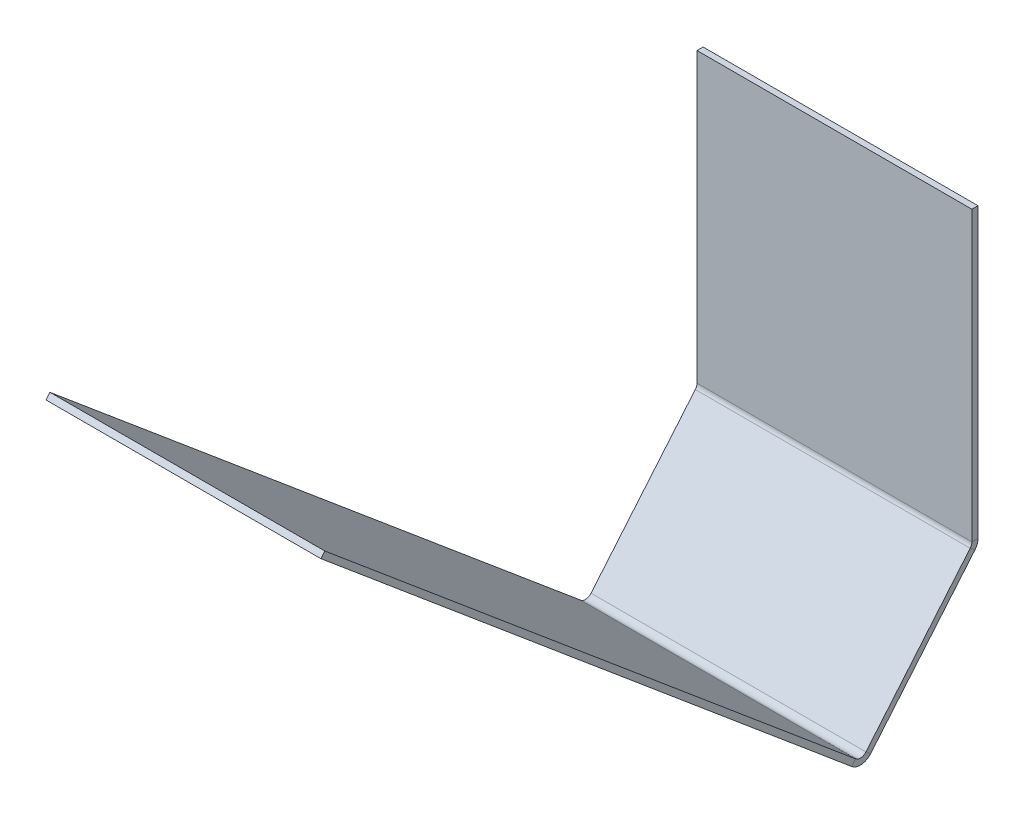
ISO-10303-21;
HEADER;
FILE_DESCRIPTION(('STEP AP214'),'2;1');
FILE_NAME('part.step','',(''),(''),'','','');
FILE_SCHEMA(('AUTOMOTIVE_DESIGN { 1 0 10303 214 1 1 1 1 }'));
ENDSEC;
DATA;
#1=APPLICATION_CONTEXT('core data for automotive mechanical design processes');
#2=APPLICATION_PROTOCOL_DEFINITION('international standard','automotive_design',2000,#1);
#3=PRODUCT_CONTEXT('',#1,'mechanical');
#4=PRODUCT('Part','Part','',(#3));
#5=PRODUCT_RELATED_PRODUCT_CATEGORY('part','',(#4));
#6=PRODUCT_DEFINITION_FORMATION('','',#4);
#7=PRODUCT_DEFINITION_CONTEXT('part definition',#1,'design');
#8=PRODUCT_DEFINITION('design','',#6,#7);
#9=PRODUCT_DEFINITION_SHAPE('','',#8);
#10=(LENGTH_UNIT() NAMED_UNIT(*) SI_UNIT(.MILLI.,.METRE.));
#11=(NAMED_UNIT(*) PLANE_ANGLE_UNIT() SI_UNIT($,.RADIAN.));
#12=(NAMED_UNIT(*) SI_UNIT($,.STERADIAN.) SOLID_ANGLE_UNIT());
#13=UNCERTAINTY_MEASURE_WITH_UNIT(LENGTH_MEASURE(1.E-05),#10,'distance_accuracy_value','');
#14=(GEOMETRIC_REPRESENTATION_CONTEXT(3) GLOBAL_UNCERTAINTY_ASSIGNED_CONTEXT((#13)) GLOBAL_UNIT_ASSIGNED_CONTEXT((#10,
#11,#12)) REPRESENTATION_CONTEXT('',''));
#15=CARTESIAN_POINT('',(0.,0.,0.));
#16=DIRECTION('',(0.,0.,1.));
#17=DIRECTION('',(1.,0.,0.));
#18=AXIS2_PLACEMENT_3D('',#15,#16,#17);
#19=CARTESIAN_POINT('',(0.,89.8724209481772,244.634432404268));
#20=DIRECTION('',(0.,-0.642787609686541,-0.766044443118977));
#21=DIRECTION('',(-1.,0.,0.));
#22=AXIS2_PLACEMENT_3D('',#19,#20,#21);
#23=PLANE('',#22);
#24=DIRECTION('',(0.,-0.766044443118977,0.642787609686541));
#25=VECTOR('',#24,1.);
#26=CARTESIAN_POINT('',(0.,89.8724209481772,244.634432404268));
#27=LINE('',#26,#25);
#28=CARTESIAN_POINT('',(1.38777878078145E-13,380.531139471248,0.742808893097247));
#29=VERTEX_POINT('',#28);
#30=CARTESIAN_POINT('',(0.,326.431417400322,46.137865729605));
#31=VERTEX_POINT('',#30);
#32=EDGE_CURVE('E66',#29,#31,#27,.T.);
#33=ORIENTED_EDGE('',*,*,#32,.T.);
#34=DIRECTION('',(1.,0.,0.));
#35=VECTOR('',#34,1.);
#36=CARTESIAN_POINT('',(2.65441725350325E-13,326.431417400322,46.1378657296051));
#37=LINE('',#36,#35);
#38=CARTESIAN_POINT('',(119.6975,326.431417400322,46.137865729605));
#39=VERTEX_POINT('',#38);
#40=EDGE_CURVE('E58',#31,#39,#37,.T.);
#41=ORIENTED_EDGE('',*,*,#40,.T.);
#42=DIRECTION('',(0.,0.766044443118977,-0.642787609686541));
#43=VECTOR('',#42,1.);
#44=CARTESIAN_POINT('',(119.6975,89.8724209481772,244.634432404268));
#45=LINE('',#44,#43);
#46=CARTESIAN_POINT('',(119.6975,380.531139471248,0.742808893097247));
#47=VERTEX_POINT('',#46);
#48=EDGE_CURVE('E74',#39,#47,#45,.T.);
#49=ORIENTED_EDGE('',*,*,#48,.T.);
#50=DIRECTION('',(1.,0.,0.));
#51=VECTOR('',#50,1.);
#52=CARTESIAN_POINT('',(0.,380.531139471248,0.742808893097247));
#53=LINE('',#52,#51);
#54=EDGE_CURVE('E234',#29,#47,#53,.T.);
#55=ORIENTED_EDGE('',*,*,#54,.F.);
#56=EDGE_LOOP('',(#33,#41,#49,#55));
#57=FACE_BOUND('',#56,.T.);
#58=ADVANCED_FACE('F49',(#57),#23,.F.);
#59=CARTESIAN_POINT('',(0.,88.1646371152576,242.599174886012));
#60=DIRECTION('',(-1.,0.,0.));
#61=DIRECTION('',(0.,0.642787609686541,0.766044443118977));
#62=AXIS2_PLACEMENT_3D('',#59,#60,#61);
#63=PLANE('',#62);
#64=DIRECTION('',(0.,-0.64278760968654,-0.766044443118977));
#65=VECTOR('',#64,1.);
#66=CARTESIAN_POINT('',(0.,324.723633567403,44.1026082113489));
#67=LINE('',#66,#65);
#68=CARTESIAN_POINT('',(0.,324.723633567403,44.1026082113487));
#69=VERTEX_POINT('',#68);
#70=EDGE_CURVE('E12',#31,#69,#67,.T.);
#71=ORIENTED_EDGE('',*,*,#70,.F.);
#72=ORIENTED_EDGE('',*,*,#32,.F.);
#73=DIRECTION('',(0.,-0.642787609686535,-0.766044443118982));
#74=VECTOR('',#73,1.);
#75=CARTESIAN_POINT('',(0.,378.823355638331,-1.29244862515696));
#76=LINE('',#75,#74);
#77=CARTESIAN_POINT('',(0.,378.823355638329,-1.29244862515898));
#78=VERTEX_POINT('',#77);
#79=EDGE_CURVE('E231',#29,#78,#76,.T.);
#80=ORIENTED_EDGE('',*,*,#79,.T.);
#81=DIRECTION('',(0.,-0.766044443118977,0.642787609686541));
#82=VECTOR('',#81,1.);
#83=CARTESIAN_POINT('',(0.,88.1646371152576,242.599174886012));
#84=LINE('',#83,#82);
#85=EDGE_CURVE('E246',#78,#69,#84,.T.);
#86=ORIENTED_EDGE('',*,*,#85,.T.);
#87=EDGE_LOOP('',(#71,#72,#80,#86));
#88=FACE_BOUND('',#87,.T.);
#89=ADVANCED_FACE('F51',(#88),#63,.T.);
#90=CARTESIAN_POINT('',(119.6975,88.1646371152576,242.599174886012));
#91=DIRECTION('',(1.,0.,0.));
#92=DIRECTION('',(0.,-0.642787609686541,-0.766044443118977));
#93=AXIS2_PLACEMENT_3D('',#90,#91,#92);
#94=PLANE('',#93);
#95=DIRECTION('',(0.,0.64278760968654,0.766044443118977));
#96=VECTOR('',#95,1.);
#97=CARTESIAN_POINT('',(119.6975,324.723633567402,44.102608211349));
#98=LINE('',#97,#96);
#99=CARTESIAN_POINT('',(119.6975,324.723633567403,44.1026082113488));
#100=VERTEX_POINT('',#99);
#101=EDGE_CURVE('E242',#100,#39,#98,.T.);
#102=ORIENTED_EDGE('',*,*,#101,.F.);
#103=DIRECTION('',(0.,0.766044443118977,-0.642787609686541));
#104=VECTOR('',#103,1.);
#105=CARTESIAN_POINT('',(119.6975,88.1646371152576,242.599174886012));
#106=LINE('',#105,#104);
#107=CARTESIAN_POINT('',(119.6975,378.823355638329,-1.29244862515898));
#108=VERTEX_POINT('',#107);
#109=EDGE_CURVE('E53',#100,#108,#106,.T.);
#110=ORIENTED_EDGE('',*,*,#109,.T.);
#111=DIRECTION('',(0.,0.642787609686535,0.766044443118982));
#112=VECTOR('',#111,1.);
#113=CARTESIAN_POINT('',(119.6975,378.823355638331,-1.29244862515696));
#114=LINE('',#113,#112);
#115=EDGE_CURVE('E237',#108,#47,#114,.T.);
#116=ORIENTED_EDGE('',*,*,#115,.T.);
#117=ORIENTED_EDGE('',*,*,#48,.F.);
#118=EDGE_LOOP('',(#102,#110,#116,#117));
#119=FACE_BOUND('',#118,.T.);
#120=ADVANCED_FACE('F259',(#119),#94,.T.);
#121=CARTESIAN_POINT('',(0.,88.1646371152576,242.599174886012));
#122=DIRECTION('',(0.,-0.642787609686541,-0.766044443118977));
#123=DIRECTION('',(-1.,0.,0.));
#124=AXIS2_PLACEMENT_3D('',#121,#122,#123);
#125=PLANE('',#124);
#126=DIRECTION('',(1.,0.,0.));
#127=VECTOR('',#126,1.);
#128=CARTESIAN_POINT('',(2.65441725350325E-13,324.723633567403,44.1026082113488));
#129=LINE('',#128,#127);
#130=EDGE_CURVE('E239',#69,#100,#129,.T.);
#131=ORIENTED_EDGE('',*,*,#130,.F.);
#132=ORIENTED_EDGE('',*,*,#85,.F.);
#133=DIRECTION('',(1.,0.,0.));
#134=VECTOR('',#133,1.);
#135=CARTESIAN_POINT('',(0.,378.823355638329,-1.29244862515898));
#136=LINE('',#135,#134);
#137=EDGE_CURVE('E228',#78,#108,#136,.T.);
#138=ORIENTED_EDGE('',*,*,#137,.T.);
#139=ORIENTED_EDGE('',*,*,#109,.F.);
#140=EDGE_LOOP('',(#131,#132,#138,#139));
#141=FACE_BOUND('',#140,.T.);
#142=ADVANCED_FACE('F301',(#141),#125,.T.);
#143=CARTESIAN_POINT('',(0.,508.,-2.65684));
#144=DIRECTION('',(0.,1.,0.));
#145=DIRECTION('',(0.,0.,1.));
#146=AXIS2_PLACEMENT_3D('',#143,#144,#145);
#147=PLANE('',#146);
#148=DIRECTION('',(-1.,0.,0.));
#149=VECTOR('',#148,1.);
#150=CARTESIAN_POINT('',(0.,508.,0.));
#151=LINE('',#150,#149);
#152=CARTESIAN_POINT('',(119.6975,508.,0.));
#153=VERTEX_POINT('',#152);
#154=CARTESIAN_POINT('',(0.,508.,0.));
#155=VERTEX_POINT('',#154);
#156=EDGE_CURVE('E203',#153,#155,#151,.T.);
#157=ORIENTED_EDGE('',*,*,#156,.F.);
#158=DIRECTION('',(0.,0.,1.));
#159=VECTOR('',#158,1.);
#160=CARTESIAN_POINT('',(119.6975,508.,-2.65684));
#161=LINE('',#160,#159);
#162=CARTESIAN_POINT('',(119.6975,508.,-2.65684));
#163=VERTEX_POINT('',#162);
#164=EDGE_CURVE('E198',#163,#153,#161,.T.);
#165=ORIENTED_EDGE('',*,*,#164,.F.);
#166=DIRECTION('',(-1.,0.,0.));
#167=VECTOR('',#166,1.);
#168=CARTESIAN_POINT('',(0.,508.,-2.65684));
#169=LINE('',#168,#167);
#170=CARTESIAN_POINT('',(0.,508.,-2.65684));
#171=VERTEX_POINT('',#170);
#172=EDGE_CURVE('E217',#163,#171,#169,.T.);
#173=ORIENTED_EDGE('',*,*,#172,.T.);
#174=DIRECTION('',(0.,0.,1.));
#175=VECTOR('',#174,1.);
#176=CARTESIAN_POINT('',(0.,508.,-2.65684));
#177=LINE('',#176,#175);
#178=EDGE_CURVE('E215',#171,#155,#177,.T.);
#179=ORIENTED_EDGE('',*,*,#178,.T.);
#180=EDGE_LOOP('',(#157,#165,#173,#179));
#181=FACE_BOUND('',#180,.T.);
#182=ADVANCED_FACE('F282',(#181),#147,.T.);
#183=CARTESIAN_POINT('',(0.,0.,-2.65684));
#184=DIRECTION('',(0.,0.,-1.));
#185=DIRECTION('',(-1.,0.,0.));
#186=AXIS2_PLACEMENT_3D('',#183,#184,#185);
#187=PLANE('',#186);
#188=DIRECTION('',(1.,0.,0.));
#189=VECTOR('',#188,1.);
#190=CARTESIAN_POINT('',(0.,382.571990132003,-2.65684));
#191=LINE('',#190,#189);
#192=CARTESIAN_POINT('',(0.,382.571990132003,-2.65684));
#193=VERTEX_POINT('',#192);
#194=CARTESIAN_POINT('',(119.6975,382.571990132003,-2.65684));
#195=VERTEX_POINT('',#194);
#196=EDGE_CURVE('E193',#193,#195,#191,.T.);
#197=ORIENTED_EDGE('',*,*,#196,.F.);
#198=DIRECTION('',(0.,-1.,0.));
#199=VECTOR('',#198,1.);
#200=CARTESIAN_POINT('',(0.,0.,-2.65684));
#201=LINE('',#200,#199);
#202=EDGE_CURVE('E213',#171,#193,#201,.T.);
#203=ORIENTED_EDGE('',*,*,#202,.F.);
#204=ORIENTED_EDGE('',*,*,#172,.F.);
#205=DIRECTION('',(0.,1.,0.));
#206=VECTOR('',#205,1.);
#207=CARTESIAN_POINT('',(119.6975,0.,-2.65684));
#208=LINE('',#207,#206);
#209=EDGE_CURVE('E201',#195,#163,#208,.T.);
#210=ORIENTED_EDGE('',*,*,#209,.F.);
#211=EDGE_LOOP('',(#197,#203,#204,#210));
#212=FACE_BOUND('',#211,.T.);
#213=ADVANCED_FACE('F268',(#212),#187,.T.);
#214=CARTESIAN_POINT('',(0.,0.,-2.65684));
#215=DIRECTION('',(-1.,0.,0.));
#216=DIRECTION('',(0.,0.,1.));
#217=AXIS2_PLACEMENT_3D('',#214,#215,#216);
#218=PLANE('',#217);
#219=DIRECTION('',(0.,0.,-1.));
#220=VECTOR('',#219,1.);
#221=CARTESIAN_POINT('',(0.,382.571990132003,-2.65683999999733));
#222=LINE('',#221,#220);
#223=CARTESIAN_POINT('',(0.,382.571990132003,0.));
#224=VERTEX_POINT('',#223);
#225=EDGE_CURVE('E220',#224,#193,#222,.T.);
#226=ORIENTED_EDGE('',*,*,#225,.F.);
#227=DIRECTION('',(0.,-1.,0.));
#228=VECTOR('',#227,1.);
#229=CARTESIAN_POINT('',(0.,0.,0.));
#230=LINE('',#229,#228);
#231=EDGE_CURVE('E211',#155,#224,#230,.T.);
#232=ORIENTED_EDGE('',*,*,#231,.F.);
#233=ORIENTED_EDGE('',*,*,#178,.F.);
#234=ORIENTED_EDGE('',*,*,#202,.T.);
#235=EDGE_LOOP('',(#226,#232,#233,#234));
#236=FACE_BOUND('',#235,.T.);
#237=ADVANCED_FACE('F276',(#236),#218,.T.);
#238=CARTESIAN_POINT('',(0.,0.,0.));
#239=DIRECTION('',(0.,0.,-1.));
#240=DIRECTION('',(-1.,0.,0.));
#241=AXIS2_PLACEMENT_3D('',#238,#239,#240);
#242=PLANE('',#241);
#243=ORIENTED_EDGE('',*,*,#231,.T.);
#244=DIRECTION('',(1.,0.,0.));
#245=VECTOR('',#244,1.);
#246=CARTESIAN_POINT('',(0.,382.571990132003,0.));
#247=LINE('',#246,#245);
#248=CARTESIAN_POINT('',(119.6975,382.571990132003,0.));
#249=VERTEX_POINT('',#248);
#250=EDGE_CURVE('E208',#224,#249,#247,.T.);
#251=ORIENTED_EDGE('',*,*,#250,.T.);
#252=DIRECTION('',(0.,1.,0.));
#253=VECTOR('',#252,1.);
#254=CARTESIAN_POINT('',(119.6975,0.,0.));
#255=LINE('',#254,#253);
#256=EDGE_CURVE('E206',#249,#153,#255,.T.);
#257=ORIENTED_EDGE('',*,*,#256,.T.);
#258=ORIENTED_EDGE('',*,*,#156,.T.);
#259=EDGE_LOOP('',(#243,#251,#257,#258));
#260=FACE_BOUND('',#259,.T.);
#261=ADVANCED_FACE('F278',(#260),#242,.F.);
#262=CARTESIAN_POINT('',(119.6975,0.,-2.65684));
#263=DIRECTION('',(1.,0.,0.));
#264=DIRECTION('',(0.,0.,-1.));
#265=AXIS2_PLACEMENT_3D('',#262,#263,#264);
#266=PLANE('',#265);
#267=DIRECTION('',(0.,0.,1.));
#268=VECTOR('',#267,1.);
#269=CARTESIAN_POINT('',(119.6975,382.571990132003,-2.65683999999733));
#270=LINE('',#269,#268);
#271=EDGE_CURVE('E223',#195,#249,#270,.T.);
#272=ORIENTED_EDGE('',*,*,#271,.F.);
#273=ORIENTED_EDGE('',*,*,#209,.T.);
#274=ORIENTED_EDGE('',*,*,#164,.T.);
#275=ORIENTED_EDGE('',*,*,#256,.F.);
#276=EDGE_LOOP('',(#272,#273,#274,#275));
#277=FACE_BOUND('',#276,.T.);
#278=ADVANCED_FACE('F284',(#277),#266,.T.);
#279=CARTESIAN_POINT('',(0.,382.571990132003,3.175));
#280=DIRECTION('',(-1.,0.,0.));
#281=DIRECTION('',(0.,0.,1.));
#282=AXIS2_PLACEMENT_3D('',#279,#280,#281);
#283=PLANE('',#282);
#284=ORIENTED_EDGE('',*,*,#79,.F.);
#285=CARTESIAN_POINT('',(1.11022302462516E-13,382.571990132003,3.175));
#286=DIRECTION('',(-1.,0.,0.));
#287=DIRECTION('',(0.,0.,1.));
#288=AXIS2_PLACEMENT_3D('',#285,#286,#287);
#289=CIRCLE('',#288,3.175);
#290=EDGE_CURVE('E181',#29,#224,#289,.F.);
#291=ORIENTED_EDGE('',*,*,#290,.T.);
#292=ORIENTED_EDGE('',*,*,#225,.T.);
#293=CARTESIAN_POINT('',(0.,382.571990132003,3.175));
#294=DIRECTION('',(1.,0.,0.));
#295=DIRECTION('',(0.,0.,1.));
#296=AXIS2_PLACEMENT_3D('',#293,#294,#295);
#297=CIRCLE('',#296,5.83184);
#298=EDGE_CURVE('E186',#78,#193,#297,.T.);
#299=ORIENTED_EDGE('',*,*,#298,.F.);
#300=EDGE_LOOP('',(#284,#291,#292,#299));
#301=FACE_BOUND('',#300,.T.);
#302=ADVANCED_FACE('F272',(#301),#283,.T.);
#303=CARTESIAN_POINT('',(119.6975,382.571990132003,3.175));
#304=DIRECTION('',(1.,0.,0.));
#305=DIRECTION('',(0.,0.,-1.));
#306=AXIS2_PLACEMENT_3D('',#303,#304,#305);
#307=PLANE('',#306);
#308=CARTESIAN_POINT('',(119.6975,382.571990132003,3.175));
#309=DIRECTION('',(-1.,0.,0.));
#310=DIRECTION('',(0.,0.,1.));
#311=AXIS2_PLACEMENT_3D('',#308,#309,#310);
#312=CIRCLE('',#311,3.175);
#313=EDGE_CURVE('E190',#249,#47,#312,.T.);
#314=ORIENTED_EDGE('',*,*,#313,.T.);
#315=ORIENTED_EDGE('',*,*,#115,.F.);
#316=CARTESIAN_POINT('',(119.6975,382.571990132003,3.175));
#317=DIRECTION('',(-1.,0.,0.));
#318=DIRECTION('',(0.,0.,-1.));
#319=AXIS2_PLACEMENT_3D('',#316,#317,#318);
#320=CIRCLE('',#319,5.83184);
#321=EDGE_CURVE('E189',#195,#108,#320,.T.);
#322=ORIENTED_EDGE('',*,*,#321,.F.);
#323=ORIENTED_EDGE('',*,*,#271,.T.);
#324=EDGE_LOOP('',(#314,#315,#322,#323));
#325=FACE_BOUND('',#324,.T.);
#326=ADVANCED_FACE('F256',(#325),#307,.T.);
#327=CARTESIAN_POINT('',(179.61700504672,382.571990132003,3.175));
#328=DIRECTION('',(-1.,0.,0.));
#329=DIRECTION('',(0.,0.,1.));
#330=AXIS2_PLACEMENT_3D('',#327,#328,#329);
#331=CYLINDRICAL_SURFACE('',#330,5.83184);
#332=ORIENTED_EDGE('',*,*,#196,.T.);
#333=ORIENTED_EDGE('',*,*,#321,.T.);
#334=ORIENTED_EDGE('',*,*,#137,.F.);
#335=ORIENTED_EDGE('',*,*,#298,.T.);
#336=EDGE_LOOP('',(#332,#333,#334,#335));
#337=FACE_BOUND('',#336,.T.);
#338=ADVANCED_FACE('F263',(#337),#331,.T.);
#339=CARTESIAN_POINT('',(179.61700504672,382.571990132003,3.175));
#340=DIRECTION('',(-1.,0.,0.));
#341=DIRECTION('',(0.,0.,1.));
#342=AXIS2_PLACEMENT_3D('',#339,#340,#341);
#343=CYLINDRICAL_SURFACE('',#342,3.175);
#344=ORIENTED_EDGE('',*,*,#250,.F.);
#345=ORIENTED_EDGE('',*,*,#290,.F.);
#346=ORIENTED_EDGE('',*,*,#54,.T.);
#347=ORIENTED_EDGE('',*,*,#313,.F.);
#348=EDGE_LOOP('',(#344,#345,#346,#347));
#349=FACE_BOUND('',#348,.T.);
#350=ADVANCED_FACE('F253',(#349),#343,.F.);
#351=CARTESIAN_POINT('',(0.,328.472268061077,48.5700568365078));
#352=DIRECTION('',(-1.,0.,0.));
#353=DIRECTION('',(0.,-1.,0.));
#354=AXIS2_PLACEMENT_3D('',#351,#352,#353);
#355=PLANE('',#354);
#356=DIRECTION('',(0.,-0.766044443118975,0.642787609686543));
#357=VECTOR('',#356,1.);
#358=CARTESIAN_POINT('',(0.,324.004819435918,52.3186913301822));
#359=LINE('',#358,#357);
#360=CARTESIAN_POINT('',(0.,326.040076954174,50.6109074972625));
#361=VERTEX_POINT('',#360);
#362=CARTESIAN_POINT('',(0.,324.004819435918,52.3186913301823));
#363=VERTEX_POINT('',#362);
#364=EDGE_CURVE('E148',#361,#363,#359,.T.);
#365=ORIENTED_EDGE('',*,*,#364,.F.);
#366=CARTESIAN_POINT('',(0.,328.472268061077,48.5700568365078));
#367=DIRECTION('',(-1.,0.,0.));
#368=DIRECTION('',(0.,-1.,0.));
#369=AXIS2_PLACEMENT_3D('',#366,#367,#368);
#370=CIRCLE('',#369,3.175);
#371=EDGE_CURVE('E159',#361,#31,#370,.F.);
#372=ORIENTED_EDGE('',*,*,#371,.T.);
#373=ORIENTED_EDGE('',*,*,#70,.T.);
#374=CARTESIAN_POINT('',(0.,328.472268061077,48.5700568365078));
#375=DIRECTION('',(1.,0.,0.));
#376=DIRECTION('',(0.,-1.,0.));
#377=AXIS2_PLACEMENT_3D('',#374,#375,#376);
#378=CIRCLE('',#377,5.83184);
#379=EDGE_CURVE('E174',#363,#69,#378,.T.);
#380=ORIENTED_EDGE('',*,*,#379,.F.);
#381=EDGE_LOOP('',(#365,#372,#373,#380));
#382=FACE_BOUND('',#381,.T.);
#383=ADVANCED_FACE('F311',(#382),#355,.T.);
#384=CARTESIAN_POINT('',(119.6975,328.472268061077,48.5700568365079));
#385=DIRECTION('',(1.,0.,0.));
#386=DIRECTION('',(0.,1.,0.));
#387=AXIS2_PLACEMENT_3D('',#384,#385,#386);
#388=PLANE('',#387);
#389=CARTESIAN_POINT('',(119.6975,328.472268061077,48.5700568365079));
#390=DIRECTION('',(-1.,0.,0.));
#391=DIRECTION('',(0.,-1.,0.));
#392=AXIS2_PLACEMENT_3D('',#389,#390,#391);
#393=CIRCLE('',#392,3.175);
#394=CARTESIAN_POINT('',(119.6975,326.040076954174,50.6109074972625));
#395=VERTEX_POINT('',#394);
#396=EDGE_CURVE('E178',#39,#395,#393,.T.);
#397=ORIENTED_EDGE('',*,*,#396,.T.);
#398=DIRECTION('',(0.,0.766044443118975,-0.642787609686543));
#399=VECTOR('',#398,1.);
#400=CARTESIAN_POINT('',(119.6975,324.004819435918,52.3186913301822));
#401=LINE('',#400,#399);
#402=CARTESIAN_POINT('',(119.6975,324.004819435918,52.3186913301822));
#403=VERTEX_POINT('',#402);
#404=EDGE_CURVE('E314',#403,#395,#401,.T.);
#405=ORIENTED_EDGE('',*,*,#404,.F.);
#406=CARTESIAN_POINT('',(119.6975,328.472268061077,48.5700568365079));
#407=DIRECTION('',(-1.,0.,0.));
#408=DIRECTION('',(0.,1.,0.));
#409=AXIS2_PLACEMENT_3D('',#406,#407,#408);
#410=CIRCLE('',#409,5.83183999999994);
#411=EDGE_CURVE('E177',#100,#403,#410,.T.);
#412=ORIENTED_EDGE('',*,*,#411,.F.);
#413=ORIENTED_EDGE('',*,*,#101,.T.);
#414=EDGE_LOOP('',(#397,#405,#412,#413));
#415=FACE_BOUND('',#414,.T.);
#416=ADVANCED_FACE('F335',(#415),#388,.T.);
#417=CARTESIAN_POINT('',(179.938753046781,328.472268061077,48.5700568365079));
#418=DIRECTION('',(-1.,0.,0.));
#419=DIRECTION('',(0.,-1.,0.));
#420=AXIS2_PLACEMENT_3D('',#417,#418,#419);
#421=CYLINDRICAL_SURFACE('',#420,5.83184);
#422=ORIENTED_EDGE('',*,*,#130,.T.);
#423=ORIENTED_EDGE('',*,*,#411,.T.);
#424=DIRECTION('',(1.,0.,0.));
#425=VECTOR('',#424,1.);
#426=CARTESIAN_POINT('',(2.60428822485665E-13,324.004819435918,52.3186913301822));
#427=LINE('',#426,#425);
#428=EDGE_CURVE('E168',#363,#403,#427,.T.);
#429=ORIENTED_EDGE('',*,*,#428,.F.);
#430=ORIENTED_EDGE('',*,*,#379,.T.);
#431=EDGE_LOOP('',(#422,#423,#429,#430));
#432=FACE_BOUND('',#431,.T.);
#433=ADVANCED_FACE('F313',(#432),#421,.T.);
#434=CARTESIAN_POINT('',(179.938753046781,328.472268061077,48.5700568365079));
#435=DIRECTION('',(-1.,0.,0.));
#436=DIRECTION('',(0.,-1.,0.));
#437=AXIS2_PLACEMENT_3D('',#434,#435,#436);
#438=CYLINDRICAL_SURFACE('',#437,3.175);
#439=ORIENTED_EDGE('',*,*,#40,.F.);
#440=ORIENTED_EDGE('',*,*,#371,.F.);
#441=DIRECTION('',(1.,0.,0.));
#442=VECTOR('',#441,1.);
#443=CARTESIAN_POINT('',(2.62712575271568E-13,326.040076954174,50.6109074972626));
#444=LINE('',#443,#442);
#445=EDGE_CURVE('E166',#361,#395,#444,.T.);
#446=ORIENTED_EDGE('',*,*,#445,.T.);
#447=ORIENTED_EDGE('',*,*,#396,.F.);
#448=EDGE_LOOP('',(#439,#440,#446,#447));
#449=FACE_BOUND('',#448,.T.);
#450=ADVANCED_FACE('F334',(#449),#438,.F.);
#451=CARTESIAN_POINT('',(2.60428822485666E-13,517.954335103276,283.458723408661));
#452=DIRECTION('',(0.,0.642787609686543,0.766044443118975));
#453=DIRECTION('',(0.,-0.766044443118975,0.642787609686543));
#454=AXIS2_PLACEMENT_3D('',#451,#452,#453);
#455=PLANE('',#454);
#456=DIRECTION('',(1.,0.,0.));
#457=VECTOR('',#456,1.);
#458=CARTESIAN_POINT('',(2.62712575271569E-13,519.989592621532,281.750939575741));
#459=LINE('',#458,#457);
#460=CARTESIAN_POINT('',(2.62712575271569E-13,519.989592621532,281.750939575741));
#461=VERTEX_POINT('',#460);
#462=CARTESIAN_POINT('',(119.6975,519.989592621532,281.750939575741));
#463=VERTEX_POINT('',#462);
#464=EDGE_CURVE('E158',#461,#463,#459,.T.);
#465=ORIENTED_EDGE('',*,*,#464,.F.);
#466=DIRECTION('',(0.,0.766044443118975,-0.642787609686543));
#467=VECTOR('',#466,1.);
#468=CARTESIAN_POINT('',(2.60428822485666E-13,517.954335103276,283.458723408661));
#469=LINE('',#468,#467);
#470=CARTESIAN_POINT('',(2.60428822485666E-13,517.954335103276,283.458723408661));
#471=VERTEX_POINT('',#470);
#472=EDGE_CURVE('E145',#471,#461,#469,.T.);
#473=ORIENTED_EDGE('',*,*,#472,.F.);
#474=DIRECTION('',(1.,0.,0.));
#475=VECTOR('',#474,1.);
#476=CARTESIAN_POINT('',(2.60428822485666E-13,517.954335103276,283.458723408661));
#477=LINE('',#476,#475);
#478=CARTESIAN_POINT('',(119.6975,517.954335103276,283.458723408661));
#479=VERTEX_POINT('',#478);
#480=EDGE_CURVE('E156',#471,#479,#477,.T.);
#481=ORIENTED_EDGE('',*,*,#480,.T.);
#482=DIRECTION('',(0.,0.766044443118975,-0.642787609686543));
#483=VECTOR('',#482,1.);
#484=CARTESIAN_POINT('',(119.6975,517.954335103276,283.458723408661));
#485=LINE('',#484,#483);
#486=EDGE_CURVE('E165',#479,#463,#485,.T.);
#487=ORIENTED_EDGE('',*,*,#486,.T.);
#488=EDGE_LOOP('',(#465,#473,#481,#487));
#489=FACE_BOUND('',#488,.T.);
#490=ADVANCED_FACE('F155',(#489),#455,.T.);
#491=CARTESIAN_POINT('',(2.60428822485666E-13,517.954335103276,283.458723408661));
#492=DIRECTION('',(0.,-0.766044443118975,0.642787609686543));
#493=DIRECTION('',(-1.,0.,0.));
#494=AXIS2_PLACEMENT_3D('',#491,#492,#493);
#495=PLANE('',#494);
#496=DIRECTION('',(0.,0.642787609686543,0.766044443118975));
#497=VECTOR('',#496,1.);
#498=CARTESIAN_POINT('',(2.60428822485666E-13,517.954335103276,283.458723408661));
#499=LINE('',#498,#497);
#500=EDGE_CURVE('E142',#363,#471,#499,.T.);
#501=ORIENTED_EDGE('',*,*,#500,.F.);
#502=ORIENTED_EDGE('',*,*,#428,.T.);
#503=DIRECTION('',(0.,-0.642787609686543,-0.766044443118975));
#504=VECTOR('',#503,1.);
#505=CARTESIAN_POINT('',(119.6975,517.954335103276,283.458723408661));
#506=LINE('',#505,#504);
#507=EDGE_CURVE('E164',#479,#403,#506,.T.);
#508=ORIENTED_EDGE('',*,*,#507,.F.);
#509=ORIENTED_EDGE('',*,*,#480,.F.);
#510=EDGE_LOOP('',(#501,#502,#508,#509));
#511=FACE_BOUND('',#510,.T.);
#512=ADVANCED_FACE('F162',(#511),#495,.T.);
#513=CARTESIAN_POINT('',(119.6975,517.954335103276,283.458723408661));
#514=DIRECTION('',(1.,0.,0.));
#515=DIRECTION('',(0.,-0.766044443118975,0.642787609686543));
#516=AXIS2_PLACEMENT_3D('',#513,#514,#515);
#517=PLANE('',#516);
#518=ORIENTED_EDGE('',*,*,#507,.T.);
#519=ORIENTED_EDGE('',*,*,#404,.T.);
#520=DIRECTION('',(0.,-0.642787609686543,-0.766044443118975));
#521=VECTOR('',#520,1.);
#522=CARTESIAN_POINT('',(119.6975,519.989592621532,281.750939575741));
#523=LINE('',#522,#521);
#524=EDGE_CURVE('E322',#463,#395,#523,.T.);
#525=ORIENTED_EDGE('',*,*,#524,.F.);
#526=ORIENTED_EDGE('',*,*,#486,.F.);
#527=EDGE_LOOP('',(#518,#519,#525,#526));
#528=FACE_BOUND('',#527,.T.);
#529=ADVANCED_FACE('F330',(#528),#517,.T.);
#530=CARTESIAN_POINT('',(2.62712575271569E-13,519.989592621532,281.750939575741));
#531=DIRECTION('',(0.,-0.766044443118975,0.642787609686543));
#532=DIRECTION('',(-1.,0.,0.));
#533=AXIS2_PLACEMENT_3D('',#530,#531,#532);
#534=PLANE('',#533);
#535=ORIENTED_EDGE('',*,*,#445,.F.);
#536=DIRECTION('',(0.,0.642787609686543,0.766044443118975));
#537=VECTOR('',#536,1.);
#538=CARTESIAN_POINT('',(2.62712575271569E-13,519.989592621532,281.750939575741));
#539=LINE('',#538,#537);
#540=EDGE_CURVE('E319',#361,#461,#539,.T.);
#541=ORIENTED_EDGE('',*,*,#540,.T.);
#542=ORIENTED_EDGE('',*,*,#464,.T.);
#543=ORIENTED_EDGE('',*,*,#524,.T.);
#544=EDGE_LOOP('',(#535,#541,#542,#543));
#545=FACE_BOUND('',#544,.T.);
#546=ADVANCED_FACE('F327',(#545),#534,.F.);
#547=CARTESIAN_POINT('',(2.60428822485666E-13,517.954335103276,283.458723408661));
#548=DIRECTION('',(-1.,0.,0.));
#549=DIRECTION('',(0.,0.766044443118975,-0.642787609686543));
#550=AXIS2_PLACEMENT_3D('',#547,#548,#549);
#551=PLANE('',#550);
#552=ORIENTED_EDGE('',*,*,#540,.F.);
#553=ORIENTED_EDGE('',*,*,#364,.T.);
#554=ORIENTED_EDGE('',*,*,#500,.T.);
#555=ORIENTED_EDGE('',*,*,#472,.T.);
#556=EDGE_LOOP('',(#552,#553,#554,#555));
#557=FACE_BOUND('',#556,.T.);
#558=ADVANCED_FACE('F144',(#557),#551,.T.);
#559=CLOSED_SHELL('',(#58,#89,#120,#142,#182,#213,#237,#261,#278,#302,#326,#338,#350,#383,#416,
#433,#450,#490,#512,#529,#546,#558));
#560=MANIFOLD_SOLID_BREP('B2',#559);
#561=ADVANCED_BREP_SHAPE_REPRESENTATION('',(#18,#560),#14);
#562=SHAPE_DEFINITION_REPRESENTATION(#9,#561);
ENDSEC;
END-ISO-10303-21;
